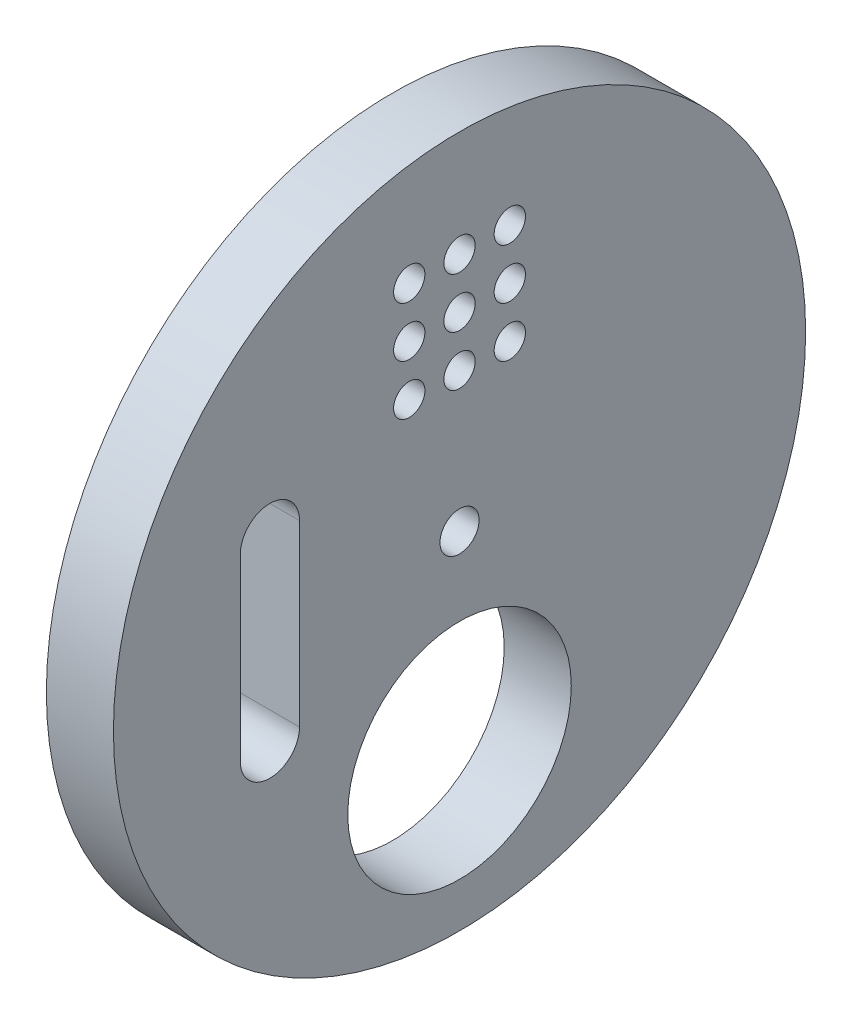
ISO-10303-21;
HEADER;
FILE_DESCRIPTION(('STEP AP214'),'2;1');
FILE_NAME('part.step','',(''),(''),'','','');
FILE_SCHEMA(('AUTOMOTIVE_DESIGN { 1 0 10303 214 1 1 1 1 }'));
ENDSEC;
DATA;
#1=APPLICATION_CONTEXT('core data for automotive mechanical design processes');
#2=APPLICATION_PROTOCOL_DEFINITION('international standard','automotive_design',2000,#1);
#3=PRODUCT_CONTEXT('',#1,'mechanical');
#4=PRODUCT('Part','Part','',(#3));
#5=PRODUCT_RELATED_PRODUCT_CATEGORY('part','',(#4));
#6=PRODUCT_DEFINITION_FORMATION('','',#4);
#7=PRODUCT_DEFINITION_CONTEXT('part definition',#1,'design');
#8=PRODUCT_DEFINITION('design','',#6,#7);
#9=PRODUCT_DEFINITION_SHAPE('','',#8);
#10=(LENGTH_UNIT() NAMED_UNIT(*) SI_UNIT(.MILLI.,.METRE.));
#11=(NAMED_UNIT(*) PLANE_ANGLE_UNIT() SI_UNIT($,.RADIAN.));
#12=(NAMED_UNIT(*) SI_UNIT($,.STERADIAN.) SOLID_ANGLE_UNIT());
#13=UNCERTAINTY_MEASURE_WITH_UNIT(LENGTH_MEASURE(1.E-05),#10,'distance_accuracy_value','');
#14=(GEOMETRIC_REPRESENTATION_CONTEXT(3) GLOBAL_UNCERTAINTY_ASSIGNED_CONTEXT((#13)) GLOBAL_UNIT_ASSIGNED_CONTEXT((#10,
#11,#12)) REPRESENTATION_CONTEXT('',''));
#15=CARTESIAN_POINT('',(0.,0.,0.));
#16=DIRECTION('',(0.,0.,1.));
#17=DIRECTION('',(1.,0.,0.));
#18=AXIS2_PLACEMENT_3D('',#15,#16,#17);
#19=CARTESIAN_POINT('',(12.,-82.0294372515229,0.));
#20=DIRECTION('',(1.,0.,0.));
#21=DIRECTION('',(0.,0.,-1.));
#22=AXIS2_PLACEMENT_3D('',#19,#20,#21);
#23=PLANE('',#22);
#24=CARTESIAN_POINT('',(12.,-65.0588745030457,4.5));
#25=DIRECTION('',(1.,0.,0.));
#26=DIRECTION('',(0.,0.,-1.));
#27=AXIS2_PLACEMENT_3D('',#24,#25,#26);
#28=CIRCLE('',#27,1.4);
#29=CARTESIAN_POINT('',(12.,-65.0588745030457,3.1));
#30=VERTEX_POINT('',#29);
#31=EDGE_CURVE('E127',#30,#30,#28,.T.);
#32=ORIENTED_EDGE('',*,*,#31,.F.);
#33=EDGE_LOOP('',(#32));
#34=FACE_BOUND('',#33,.T.);
#35=CARTESIAN_POINT('',(12.,-69.5588745030457,0.));
#36=DIRECTION('',(1.,0.,0.));
#37=DIRECTION('',(0.,0.,-1.));
#38=AXIS2_PLACEMENT_3D('',#35,#36,#37);
#39=CIRCLE('',#38,1.4);
#40=CARTESIAN_POINT('',(12.,-69.5588745030457,-1.4));
#41=VERTEX_POINT('',#40);
#42=EDGE_CURVE('E137',#41,#41,#39,.T.);
#43=ORIENTED_EDGE('',*,*,#42,.F.);
#44=EDGE_LOOP('',(#43));
#45=FACE_BOUND('',#44,.T.);
#46=CARTESIAN_POINT('',(12.,-65.0588745030457,0.));
#47=DIRECTION('',(1.,0.,0.));
#48=DIRECTION('',(0.,0.,-1.));
#49=AXIS2_PLACEMENT_3D('',#46,#47,#48);
#50=CIRCLE('',#49,1.4);
#51=CARTESIAN_POINT('',(12.,-65.0588745030457,-1.4));
#52=VERTEX_POINT('',#51);
#53=EDGE_CURVE('E149',#52,#52,#50,.T.);
#54=ORIENTED_EDGE('',*,*,#53,.F.);
#55=EDGE_LOOP('',(#54));
#56=FACE_BOUND('',#55,.T.);
#57=CARTESIAN_POINT('',(12.,-60.5588745030457,0.));
#58=DIRECTION('',(1.,0.,0.));
#59=DIRECTION('',(0.,0.,-1.));
#60=AXIS2_PLACEMENT_3D('',#57,#58,#59);
#61=CIRCLE('',#60,1.4);
#62=CARTESIAN_POINT('',(12.,-60.5588745030457,-1.4));
#63=VERTEX_POINT('',#62);
#64=EDGE_CURVE('E161',#63,#63,#61,.T.);
#65=ORIENTED_EDGE('',*,*,#64,.F.);
#66=EDGE_LOOP('',(#65));
#67=FACE_BOUND('',#66,.T.);
#68=CARTESIAN_POINT('',(12.,-60.5588745030457,4.5));
#69=DIRECTION('',(1.,0.,0.));
#70=DIRECTION('',(0.,0.,-1.));
#71=AXIS2_PLACEMENT_3D('',#68,#69,#70);
#72=CIRCLE('',#71,1.4);
#73=CARTESIAN_POINT('',(12.,-60.5588745030457,3.1));
#74=VERTEX_POINT('',#73);
#75=EDGE_CURVE('E172',#74,#74,#72,.T.);
#76=ORIENTED_EDGE('',*,*,#75,.F.);
#77=EDGE_LOOP('',(#76));
#78=FACE_BOUND('',#77,.T.);
#79=CARTESIAN_POINT('',(12.,-82.0294372515229,0.));
#80=DIRECTION('',(1.,0.,0.));
#81=DIRECTION('',(0.,0.,-1.));
#82=AXIS2_PLACEMENT_3D('',#79,#80,#81);
#83=CIRCLE('',#82,30.9705627484771);
#84=CARTESIAN_POINT('',(12.,-82.0294372515229,-30.9705627484771));
#85=VERTEX_POINT('',#84);
#86=EDGE_CURVE('E11',#85,#85,#83,.T.);
#87=ORIENTED_EDGE('',*,*,#86,.T.);
#88=EDGE_LOOP('',(#87));
#89=FACE_BOUND('',#88,.T.);
#90=CARTESIAN_POINT('',(12.,-99.,0.));
#91=DIRECTION('',(1.,0.,0.));
#92=DIRECTION('',(0.,0.,-1.));
#93=AXIS2_PLACEMENT_3D('',#90,#91,#92);
#94=CIRCLE('',#93,10.);
#95=CARTESIAN_POINT('',(12.,-99.,-10.));
#96=VERTEX_POINT('',#95);
#97=EDGE_CURVE('E45',#96,#96,#94,.T.);
#98=ORIENTED_EDGE('',*,*,#97,.F.);
#99=EDGE_LOOP('',(#98));
#100=FACE_BOUND('',#99,.T.);
#101=DIRECTION('',(0.,-1.,0.));
#102=VECTOR('',#101,1.);
#103=CARTESIAN_POINT('',(12.,-74.0294372515229,19.6205627484771));
#104=LINE('',#103,#102);
#105=CARTESIAN_POINT('',(12.,-74.0294372515229,19.6205627484771));
#106=VERTEX_POINT('',#105);
#107=CARTESIAN_POINT('',(12.,-90.0294372515229,19.6205627484771));
#108=VERTEX_POINT('',#107);
#109=EDGE_CURVE('E98',#106,#108,#104,.T.);
#110=ORIENTED_EDGE('',*,*,#109,.F.);
#111=CARTESIAN_POINT('',(12.,-74.0294372515229,16.9705627484772));
#112=DIRECTION('',(1.,0.,0.));
#113=DIRECTION('',(0.,0.,-1.));
#114=AXIS2_PLACEMENT_3D('',#111,#112,#113);
#115=CIRCLE('',#114,2.64999999999999);
#116=CARTESIAN_POINT('',(12.,-74.0294372515229,14.3205627484772));
#117=VERTEX_POINT('',#116);
#118=EDGE_CURVE('E96',#117,#106,#115,.T.);
#119=ORIENTED_EDGE('',*,*,#118,.F.);
#120=DIRECTION('',(0.,1.,0.));
#121=VECTOR('',#120,1.);
#122=CARTESIAN_POINT('',(12.,-74.0294372515229,14.3205627484772));
#123=LINE('',#122,#121);
#124=CARTESIAN_POINT('',(12.,-90.0294372515229,14.3205627484772));
#125=VERTEX_POINT('',#124);
#126=EDGE_CURVE('E58',#125,#117,#123,.T.);
#127=ORIENTED_EDGE('',*,*,#126,.F.);
#128=CARTESIAN_POINT('',(12.,-90.0294372515229,16.9705627484771));
#129=DIRECTION('',(1.,0.,0.));
#130=DIRECTION('',(0.,0.,-1.));
#131=AXIS2_PLACEMENT_3D('',#128,#129,#130);
#132=CIRCLE('',#131,2.64999999999999);
#133=EDGE_CURVE('E90',#108,#125,#132,.T.);
#134=ORIENTED_EDGE('',*,*,#133,.F.);
#135=EDGE_LOOP('',(#110,#119,#127,#134));
#136=FACE_BOUND('',#135,.T.);
#137=CARTESIAN_POINT('',(12.,-82.0294372515229,0.));
#138=DIRECTION('',(1.,0.,0.));
#139=DIRECTION('',(0.,0.,-1.));
#140=AXIS2_PLACEMENT_3D('',#137,#138,#139);
#141=CIRCLE('',#140,1.75);
#142=CARTESIAN_POINT('',(12.,-82.0294372515229,-1.75));
#143=VERTEX_POINT('',#142);
#144=EDGE_CURVE('E167',#143,#143,#141,.T.);
#145=ORIENTED_EDGE('',*,*,#144,.F.);
#146=EDGE_LOOP('',(#145));
#147=FACE_BOUND('',#146,.T.);
#148=CARTESIAN_POINT('',(12.,-60.5588745030457,-4.5));
#149=DIRECTION('',(1.,0.,0.));
#150=DIRECTION('',(0.,0.,-1.));
#151=AXIS2_PLACEMENT_3D('',#148,#149,#150);
#152=CIRCLE('',#151,1.4);
#153=CARTESIAN_POINT('',(12.,-60.5588745030457,-5.9));
#154=VERTEX_POINT('',#153);
#155=EDGE_CURVE('E155',#154,#154,#152,.T.);
#156=ORIENTED_EDGE('',*,*,#155,.F.);
#157=EDGE_LOOP('',(#156));
#158=FACE_BOUND('',#157,.T.);
#159=CARTESIAN_POINT('',(12.,-65.0588745030457,-4.5));
#160=DIRECTION('',(1.,0.,0.));
#161=DIRECTION('',(0.,0.,-1.));
#162=AXIS2_PLACEMENT_3D('',#159,#160,#161);
#163=CIRCLE('',#162,1.4);
#164=CARTESIAN_POINT('',(12.,-65.0588745030457,-5.9));
#165=VERTEX_POINT('',#164);
#166=EDGE_CURVE('E143',#165,#165,#163,.T.);
#167=ORIENTED_EDGE('',*,*,#166,.F.);
#168=EDGE_LOOP('',(#167));
#169=FACE_BOUND('',#168,.T.);
#170=CARTESIAN_POINT('',(12.,-69.5588745030457,-4.5));
#171=DIRECTION('',(1.,0.,0.));
#172=DIRECTION('',(0.,0.,-1.));
#173=AXIS2_PLACEMENT_3D('',#170,#171,#172);
#174=CIRCLE('',#173,1.4);
#175=CARTESIAN_POINT('',(12.,-69.5588745030457,-5.9));
#176=VERTEX_POINT('',#175);
#177=EDGE_CURVE('E130',#176,#176,#174,.T.);
#178=ORIENTED_EDGE('',*,*,#177,.F.);
#179=EDGE_LOOP('',(#178));
#180=FACE_BOUND('',#179,.T.);
#181=CARTESIAN_POINT('',(12.,-69.5588745030457,4.5));
#182=DIRECTION('',(1.,0.,0.));
#183=DIRECTION('',(0.,0.,-1.));
#184=AXIS2_PLACEMENT_3D('',#181,#182,#183);
#185=CIRCLE('',#184,1.4);
#186=CARTESIAN_POINT('',(12.,-69.5588745030457,3.1));
#187=VERTEX_POINT('',#186);
#188=EDGE_CURVE('E126',#187,#187,#185,.T.);
#189=ORIENTED_EDGE('',*,*,#188,.F.);
#190=EDGE_LOOP('',(#189));
#191=FACE_BOUND('',#190,.T.);
#192=ADVANCED_FACE('F37',(#34,#45,#56,#67,#78,#89,#100,#136,#147,#158,#169,#180,#191),#23,.T.);
#193=CARTESIAN_POINT('',(12.,-82.0294372515229,0.));
#194=DIRECTION('',(-1.,0.,0.));
#195=DIRECTION('',(0.,0.,1.));
#196=AXIS2_PLACEMENT_3D('',#193,#194,#195);
#197=CYLINDRICAL_SURFACE('',#196,30.9705627484771);
#198=ORIENTED_EDGE('',*,*,#86,.F.);
#199=EDGE_LOOP('',(#198));
#200=FACE_BOUND('',#199,.T.);
#201=CARTESIAN_POINT('',(6.,-82.0294372515229,0.));
#202=DIRECTION('',(-1.,0.,0.));
#203=DIRECTION('',(0.,0.,1.));
#204=AXIS2_PLACEMENT_3D('',#201,#202,#203);
#205=CIRCLE('',#204,30.9705627484771);
#206=CARTESIAN_POINT('',(6.,-82.0294372515229,30.9705627484771));
#207=VERTEX_POINT('',#206);
#208=EDGE_CURVE('E118',#207,#207,#205,.T.);
#209=ORIENTED_EDGE('',*,*,#208,.F.);
#210=EDGE_LOOP('',(#209));
#211=FACE_BOUND('',#210,.T.);
#212=ADVANCED_FACE('F39',(#200,#211),#197,.T.);
#213=CARTESIAN_POINT('',(12.,-99.,0.));
#214=DIRECTION('',(-1.,0.,0.));
#215=DIRECTION('',(0.,0.,1.));
#216=AXIS2_PLACEMENT_3D('',#213,#214,#215);
#217=CYLINDRICAL_SURFACE('',#216,10.);
#218=ORIENTED_EDGE('',*,*,#97,.T.);
#219=EDGE_LOOP('',(#218));
#220=FACE_BOUND('',#219,.T.);
#221=CARTESIAN_POINT('',(6.,-99.,0.));
#222=DIRECTION('',(1.,0.,0.));
#223=DIRECTION('',(0.,0.,-1.));
#224=AXIS2_PLACEMENT_3D('',#221,#222,#223);
#225=CIRCLE('',#224,10.);
#226=CARTESIAN_POINT('',(6.,-99.,-10.));
#227=VERTEX_POINT('',#226);
#228=EDGE_CURVE('E108',#227,#227,#225,.T.);
#229=ORIENTED_EDGE('',*,*,#228,.F.);
#230=EDGE_LOOP('',(#229));
#231=FACE_BOUND('',#230,.T.);
#232=ADVANCED_FACE('F256',(#220,#231),#217,.F.);
#233=CARTESIAN_POINT('',(12.,-74.0294372515229,16.9705627484772));
#234=DIRECTION('',(-1.,0.,0.));
#235=DIRECTION('',(0.,0.,1.));
#236=AXIS2_PLACEMENT_3D('',#233,#234,#235);
#237=CYLINDRICAL_SURFACE('',#236,2.64999999999999);
#238=CARTESIAN_POINT('',(6.,-74.0294372515229,16.9705627484772));
#239=DIRECTION('',(1.,0.,0.));
#240=DIRECTION('',(0.,0.,-1.));
#241=AXIS2_PLACEMENT_3D('',#238,#239,#240);
#242=CIRCLE('',#241,2.64999999999999);
#243=CARTESIAN_POINT('',(6.,-74.0294372515229,14.3205627484772));
#244=VERTEX_POINT('',#243);
#245=CARTESIAN_POINT('',(6.,-74.0294372515229,19.6205627484771));
#246=VERTEX_POINT('',#245);
#247=EDGE_CURVE('E176',#244,#246,#242,.T.);
#248=ORIENTED_EDGE('',*,*,#247,.F.);
#249=DIRECTION('',(-1.,0.,0.));
#250=VECTOR('',#249,1.);
#251=CARTESIAN_POINT('',(12.,-74.0294372515229,14.3205627484772));
#252=LINE('',#251,#250);
#253=EDGE_CURVE('E92',#117,#244,#252,.T.);
#254=ORIENTED_EDGE('',*,*,#253,.F.);
#255=ORIENTED_EDGE('',*,*,#118,.T.);
#256=DIRECTION('',(-1.,0.,0.));
#257=VECTOR('',#256,1.);
#258=CARTESIAN_POINT('',(12.,-74.0294372515229,19.6205627484771));
#259=LINE('',#258,#257);
#260=EDGE_CURVE('E104',#106,#246,#259,.T.);
#261=ORIENTED_EDGE('',*,*,#260,.T.);
#262=EDGE_LOOP('',(#248,#254,#255,#261));
#263=FACE_BOUND('',#262,.T.);
#264=ADVANCED_FACE('F186',(#263),#237,.F.);
#265=CARTESIAN_POINT('',(12.,-74.0294372515229,19.6205627484771));
#266=DIRECTION('',(0.,0.,-1.));
#267=DIRECTION('',(0.,1.,0.));
#268=AXIS2_PLACEMENT_3D('',#265,#266,#267);
#269=PLANE('',#268);
#270=DIRECTION('',(0.,-1.,0.));
#271=VECTOR('',#270,1.);
#272=CARTESIAN_POINT('',(6.,-74.0294372515229,19.6205627484771));
#273=LINE('',#272,#271);
#274=CARTESIAN_POINT('',(6.,-90.0294372515229,19.6205627484771));
#275=VERTEX_POINT('',#274);
#276=EDGE_CURVE('E71',#246,#275,#273,.T.);
#277=ORIENTED_EDGE('',*,*,#276,.F.);
#278=ORIENTED_EDGE('',*,*,#260,.F.);
#279=ORIENTED_EDGE('',*,*,#109,.T.);
#280=DIRECTION('',(-1.,0.,0.));
#281=VECTOR('',#280,1.);
#282=CARTESIAN_POINT('',(12.,-90.0294372515229,19.6205627484771));
#283=LINE('',#282,#281);
#284=EDGE_CURVE('E91',#108,#275,#283,.T.);
#285=ORIENTED_EDGE('',*,*,#284,.T.);
#286=EDGE_LOOP('',(#277,#278,#279,#285));
#287=FACE_BOUND('',#286,.T.);
#288=ADVANCED_FACE('F184',(#287),#269,.T.);
#289=CARTESIAN_POINT('',(12.,-90.0294372515229,16.9705627484771));
#290=DIRECTION('',(-1.,0.,0.));
#291=DIRECTION('',(0.,0.,1.));
#292=AXIS2_PLACEMENT_3D('',#289,#290,#291);
#293=CYLINDRICAL_SURFACE('',#292,2.64999999999999);
#294=CARTESIAN_POINT('',(6.,-90.0294372515229,16.9705627484771));
#295=DIRECTION('',(1.,0.,0.));
#296=DIRECTION('',(0.,0.,-1.));
#297=AXIS2_PLACEMENT_3D('',#294,#295,#296);
#298=CIRCLE('',#297,2.64999999999999);
#299=CARTESIAN_POINT('',(6.,-90.0294372515229,14.3205627484772));
#300=VERTEX_POINT('',#299);
#301=EDGE_CURVE('E82',#275,#300,#298,.T.);
#302=ORIENTED_EDGE('',*,*,#301,.F.);
#303=ORIENTED_EDGE('',*,*,#284,.F.);
#304=ORIENTED_EDGE('',*,*,#133,.T.);
#305=DIRECTION('',(-1.,0.,0.));
#306=VECTOR('',#305,1.);
#307=CARTESIAN_POINT('',(12.,-90.0294372515229,14.3205627484772));
#308=LINE('',#307,#306);
#309=EDGE_CURVE('E52',#125,#300,#308,.T.);
#310=ORIENTED_EDGE('',*,*,#309,.T.);
#311=EDGE_LOOP('',(#302,#303,#304,#310));
#312=FACE_BOUND('',#311,.T.);
#313=ADVANCED_FACE('F88',(#312),#293,.F.);
#314=CARTESIAN_POINT('',(12.,-74.0294372515229,14.3205627484772));
#315=DIRECTION('',(0.,0.,1.));
#316=DIRECTION('',(0.,-1.,0.));
#317=AXIS2_PLACEMENT_3D('',#314,#315,#316);
#318=PLANE('',#317);
#319=DIRECTION('',(0.,1.,0.));
#320=VECTOR('',#319,1.);
#321=CARTESIAN_POINT('',(6.,-74.0294372515229,14.3205627484772));
#322=LINE('',#321,#320);
#323=EDGE_CURVE('E77',#300,#244,#322,.T.);
#324=ORIENTED_EDGE('',*,*,#323,.F.);
#325=ORIENTED_EDGE('',*,*,#309,.F.);
#326=ORIENTED_EDGE('',*,*,#126,.T.);
#327=ORIENTED_EDGE('',*,*,#253,.T.);
#328=EDGE_LOOP('',(#324,#325,#326,#327));
#329=FACE_BOUND('',#328,.T.);
#330=ADVANCED_FACE('F94',(#329),#318,.T.);
#331=CARTESIAN_POINT('',(12.,-60.5588745030457,4.5));
#332=DIRECTION('',(-1.,0.,0.));
#333=DIRECTION('',(0.,0.,1.));
#334=AXIS2_PLACEMENT_3D('',#331,#332,#333);
#335=CYLINDRICAL_SURFACE('',#334,1.4);
#336=ORIENTED_EDGE('',*,*,#75,.T.);
#337=EDGE_LOOP('',(#336));
#338=FACE_BOUND('',#337,.T.);
#339=CARTESIAN_POINT('',(6.,-60.5588745030457,4.5));
#340=DIRECTION('',(1.,0.,0.));
#341=DIRECTION('',(0.,0.,-1.));
#342=AXIS2_PLACEMENT_3D('',#339,#340,#341);
#343=CIRCLE('',#342,1.4);
#344=CARTESIAN_POINT('',(6.,-60.5588745030457,3.1));
#345=VERTEX_POINT('',#344);
#346=EDGE_CURVE('E110',#345,#345,#343,.T.);
#347=ORIENTED_EDGE('',*,*,#346,.F.);
#348=EDGE_LOOP('',(#347));
#349=FACE_BOUND('',#348,.T.);
#350=ADVANCED_FACE('F243',(#338,#349),#335,.F.);
#351=CARTESIAN_POINT('',(12.,-82.0294372515229,0.));
#352=DIRECTION('',(-1.,0.,0.));
#353=DIRECTION('',(0.,0.,1.));
#354=AXIS2_PLACEMENT_3D('',#351,#352,#353);
#355=CYLINDRICAL_SURFACE('',#354,1.75);
#356=ORIENTED_EDGE('',*,*,#144,.T.);
#357=EDGE_LOOP('',(#356));
#358=FACE_BOUND('',#357,.T.);
#359=CARTESIAN_POINT('',(6.,-82.0294372515229,0.));
#360=DIRECTION('',(1.,0.,0.));
#361=DIRECTION('',(0.,0.,-1.));
#362=AXIS2_PLACEMENT_3D('',#359,#360,#361);
#363=CIRCLE('',#362,1.75);
#364=CARTESIAN_POINT('',(6.,-82.0294372515229,-1.75));
#365=VERTEX_POINT('',#364);
#366=EDGE_CURVE('E115',#365,#365,#363,.T.);
#367=ORIENTED_EDGE('',*,*,#366,.F.);
#368=EDGE_LOOP('',(#367));
#369=FACE_BOUND('',#368,.T.);
#370=ADVANCED_FACE('F239',(#358,#369),#355,.F.);
#371=CARTESIAN_POINT('',(12.,-60.5588745030457,0.));
#372=DIRECTION('',(-1.,0.,0.));
#373=DIRECTION('',(0.,0.,1.));
#374=AXIS2_PLACEMENT_3D('',#371,#372,#373);
#375=CYLINDRICAL_SURFACE('',#374,1.4);
#376=ORIENTED_EDGE('',*,*,#64,.T.);
#377=EDGE_LOOP('',(#376));
#378=FACE_BOUND('',#377,.T.);
#379=CARTESIAN_POINT('',(6.,-60.5588745030457,0.));
#380=DIRECTION('',(1.,0.,0.));
#381=DIRECTION('',(0.,0.,-1.));
#382=AXIS2_PLACEMENT_3D('',#379,#380,#381);
#383=CIRCLE('',#382,1.4);
#384=CARTESIAN_POINT('',(6.,-60.5588745030457,-1.4));
#385=VERTEX_POINT('',#384);
#386=EDGE_CURVE('E164',#385,#385,#383,.T.);
#387=ORIENTED_EDGE('',*,*,#386,.F.);
#388=EDGE_LOOP('',(#387));
#389=FACE_BOUND('',#388,.T.);
#390=ADVANCED_FACE('F235',(#378,#389),#375,.F.);
#391=CARTESIAN_POINT('',(12.,-60.5588745030457,-4.5));
#392=DIRECTION('',(-1.,0.,0.));
#393=DIRECTION('',(0.,0.,1.));
#394=AXIS2_PLACEMENT_3D('',#391,#392,#393);
#395=CYLINDRICAL_SURFACE('',#394,1.4);
#396=ORIENTED_EDGE('',*,*,#155,.T.);
#397=EDGE_LOOP('',(#396));
#398=FACE_BOUND('',#397,.T.);
#399=CARTESIAN_POINT('',(6.,-60.5588745030457,-4.5));
#400=DIRECTION('',(1.,0.,0.));
#401=DIRECTION('',(0.,0.,-1.));
#402=AXIS2_PLACEMENT_3D('',#399,#400,#401);
#403=CIRCLE('',#402,1.4);
#404=CARTESIAN_POINT('',(6.,-60.5588745030457,-5.9));
#405=VERTEX_POINT('',#404);
#406=EDGE_CURVE('E158',#405,#405,#403,.T.);
#407=ORIENTED_EDGE('',*,*,#406,.F.);
#408=EDGE_LOOP('',(#407));
#409=FACE_BOUND('',#408,.T.);
#410=ADVANCED_FACE('F231',(#398,#409),#395,.F.);
#411=CARTESIAN_POINT('',(12.,-65.0588745030457,0.));
#412=DIRECTION('',(-1.,0.,0.));
#413=DIRECTION('',(0.,0.,1.));
#414=AXIS2_PLACEMENT_3D('',#411,#412,#413);
#415=CYLINDRICAL_SURFACE('',#414,1.4);
#416=ORIENTED_EDGE('',*,*,#53,.T.);
#417=EDGE_LOOP('',(#416));
#418=FACE_BOUND('',#417,.T.);
#419=CARTESIAN_POINT('',(6.,-65.0588745030457,0.));
#420=DIRECTION('',(1.,0.,0.));
#421=DIRECTION('',(0.,0.,-1.));
#422=AXIS2_PLACEMENT_3D('',#419,#420,#421);
#423=CIRCLE('',#422,1.4);
#424=CARTESIAN_POINT('',(6.,-65.0588745030457,-1.4));
#425=VERTEX_POINT('',#424);
#426=EDGE_CURVE('E152',#425,#425,#423,.T.);
#427=ORIENTED_EDGE('',*,*,#426,.F.);
#428=EDGE_LOOP('',(#427));
#429=FACE_BOUND('',#428,.T.);
#430=ADVANCED_FACE('F227',(#418,#429),#415,.F.);
#431=CARTESIAN_POINT('',(12.,-65.0588745030457,-4.5));
#432=DIRECTION('',(-1.,0.,0.));
#433=DIRECTION('',(0.,0.,1.));
#434=AXIS2_PLACEMENT_3D('',#431,#432,#433);
#435=CYLINDRICAL_SURFACE('',#434,1.4);
#436=ORIENTED_EDGE('',*,*,#166,.T.);
#437=EDGE_LOOP('',(#436));
#438=FACE_BOUND('',#437,.T.);
#439=CARTESIAN_POINT('',(6.,-65.0588745030457,-4.5));
#440=DIRECTION('',(1.,0.,0.));
#441=DIRECTION('',(0.,0.,-1.));
#442=AXIS2_PLACEMENT_3D('',#439,#440,#441);
#443=CIRCLE('',#442,1.4);
#444=CARTESIAN_POINT('',(6.,-65.0588745030457,-5.9));
#445=VERTEX_POINT('',#444);
#446=EDGE_CURVE('E146',#445,#445,#443,.T.);
#447=ORIENTED_EDGE('',*,*,#446,.F.);
#448=EDGE_LOOP('',(#447));
#449=FACE_BOUND('',#448,.T.);
#450=ADVANCED_FACE('F223',(#438,#449),#435,.F.);
#451=CARTESIAN_POINT('',(12.,-69.5588745030457,0.));
#452=DIRECTION('',(-1.,0.,0.));
#453=DIRECTION('',(0.,0.,1.));
#454=AXIS2_PLACEMENT_3D('',#451,#452,#453);
#455=CYLINDRICAL_SURFACE('',#454,1.4);
#456=ORIENTED_EDGE('',*,*,#42,.T.);
#457=EDGE_LOOP('',(#456));
#458=FACE_BOUND('',#457,.T.);
#459=CARTESIAN_POINT('',(6.,-69.5588745030457,0.));
#460=DIRECTION('',(1.,0.,0.));
#461=DIRECTION('',(0.,0.,-1.));
#462=AXIS2_PLACEMENT_3D('',#459,#460,#461);
#463=CIRCLE('',#462,1.4);
#464=CARTESIAN_POINT('',(6.,-69.5588745030457,-1.4));
#465=VERTEX_POINT('',#464);
#466=EDGE_CURVE('E140',#465,#465,#463,.T.);
#467=ORIENTED_EDGE('',*,*,#466,.F.);
#468=EDGE_LOOP('',(#467));
#469=FACE_BOUND('',#468,.T.);
#470=ADVANCED_FACE('F219',(#458,#469),#455,.F.);
#471=CARTESIAN_POINT('',(12.,-69.5588745030457,-4.5));
#472=DIRECTION('',(-1.,0.,0.));
#473=DIRECTION('',(0.,0.,1.));
#474=AXIS2_PLACEMENT_3D('',#471,#472,#473);
#475=CYLINDRICAL_SURFACE('',#474,1.4);
#476=ORIENTED_EDGE('',*,*,#177,.T.);
#477=EDGE_LOOP('',(#476));
#478=FACE_BOUND('',#477,.T.);
#479=CARTESIAN_POINT('',(6.,-69.5588745030457,-4.5));
#480=DIRECTION('',(1.,0.,0.));
#481=DIRECTION('',(0.,0.,-1.));
#482=AXIS2_PLACEMENT_3D('',#479,#480,#481);
#483=CIRCLE('',#482,1.4);
#484=CARTESIAN_POINT('',(6.,-69.5588745030457,-5.9));
#485=VERTEX_POINT('',#484);
#486=EDGE_CURVE('E134',#485,#485,#483,.T.);
#487=ORIENTED_EDGE('',*,*,#486,.F.);
#488=EDGE_LOOP('',(#487));
#489=FACE_BOUND('',#488,.T.);
#490=ADVANCED_FACE('F213',(#478,#489),#475,.F.);
#491=CARTESIAN_POINT('',(12.,-65.0588745030457,4.5));
#492=DIRECTION('',(-1.,0.,0.));
#493=DIRECTION('',(0.,0.,1.));
#494=AXIS2_PLACEMENT_3D('',#491,#492,#493);
#495=CYLINDRICAL_SURFACE('',#494,1.4);
#496=ORIENTED_EDGE('',*,*,#31,.T.);
#497=EDGE_LOOP('',(#496));
#498=FACE_BOUND('',#497,.T.);
#499=CARTESIAN_POINT('',(6.,-65.0588745030457,4.5));
#500=DIRECTION('',(1.,0.,0.));
#501=DIRECTION('',(0.,0.,-1.));
#502=AXIS2_PLACEMENT_3D('',#499,#500,#501);
#503=CIRCLE('',#502,1.4);
#504=CARTESIAN_POINT('',(6.,-65.0588745030457,3.1));
#505=VERTEX_POINT('',#504);
#506=EDGE_CURVE('E131',#505,#505,#503,.T.);
#507=ORIENTED_EDGE('',*,*,#506,.F.);
#508=EDGE_LOOP('',(#507));
#509=FACE_BOUND('',#508,.T.);
#510=ADVANCED_FACE('F206',(#498,#509),#495,.F.);
#511=CARTESIAN_POINT('',(12.,-69.5588745030457,4.5));
#512=DIRECTION('',(-1.,0.,0.));
#513=DIRECTION('',(0.,0.,1.));
#514=AXIS2_PLACEMENT_3D('',#511,#512,#513);
#515=CYLINDRICAL_SURFACE('',#514,1.4);
#516=ORIENTED_EDGE('',*,*,#188,.T.);
#517=EDGE_LOOP('',(#516));
#518=FACE_BOUND('',#517,.T.);
#519=CARTESIAN_POINT('',(6.,-69.5588745030457,4.5));
#520=DIRECTION('',(1.,0.,0.));
#521=DIRECTION('',(0.,0.,-1.));
#522=AXIS2_PLACEMENT_3D('',#519,#520,#521);
#523=CIRCLE('',#522,1.4);
#524=CARTESIAN_POINT('',(6.,-69.5588745030457,3.1));
#525=VERTEX_POINT('',#524);
#526=EDGE_CURVE('E111',#525,#525,#523,.T.);
#527=ORIENTED_EDGE('',*,*,#526,.F.);
#528=EDGE_LOOP('',(#527));
#529=FACE_BOUND('',#528,.T.);
#530=ADVANCED_FACE('F203',(#518,#529),#515,.F.);
#531=CARTESIAN_POINT('',(6.,0.,0.));
#532=DIRECTION('',(-1.,0.,0.));
#533=DIRECTION('',(0.,0.,1.));
#534=AXIS2_PLACEMENT_3D('',#531,#532,#533);
#535=PLANE('',#534);
#536=ORIENTED_EDGE('',*,*,#228,.T.);
#537=EDGE_LOOP('',(#536));
#538=FACE_BOUND('',#537,.T.);
#539=ORIENTED_EDGE('',*,*,#526,.T.);
#540=EDGE_LOOP('',(#539));
#541=FACE_BOUND('',#540,.T.);
#542=ORIENTED_EDGE('',*,*,#208,.T.);
#543=EDGE_LOOP('',(#542));
#544=FACE_BOUND('',#543,.T.);
#545=ORIENTED_EDGE('',*,*,#323,.T.);
#546=ORIENTED_EDGE('',*,*,#247,.T.);
#547=ORIENTED_EDGE('',*,*,#276,.T.);
#548=ORIENTED_EDGE('',*,*,#301,.T.);
#549=EDGE_LOOP('',(#545,#546,#547,#548));
#550=FACE_BOUND('',#549,.T.);
#551=ORIENTED_EDGE('',*,*,#346,.T.);
#552=EDGE_LOOP('',(#551));
#553=FACE_BOUND('',#552,.T.);
#554=ORIENTED_EDGE('',*,*,#366,.T.);
#555=EDGE_LOOP('',(#554));
#556=FACE_BOUND('',#555,.T.);
#557=ORIENTED_EDGE('',*,*,#386,.T.);
#558=EDGE_LOOP('',(#557));
#559=FACE_BOUND('',#558,.T.);
#560=ORIENTED_EDGE('',*,*,#406,.T.);
#561=EDGE_LOOP('',(#560));
#562=FACE_BOUND('',#561,.T.);
#563=ORIENTED_EDGE('',*,*,#426,.T.);
#564=EDGE_LOOP('',(#563));
#565=FACE_BOUND('',#564,.T.);
#566=ORIENTED_EDGE('',*,*,#446,.T.);
#567=EDGE_LOOP('',(#566));
#568=FACE_BOUND('',#567,.T.);
#569=ORIENTED_EDGE('',*,*,#466,.T.);
#570=EDGE_LOOP('',(#569));
#571=FACE_BOUND('',#570,.T.);
#572=ORIENTED_EDGE('',*,*,#486,.T.);
#573=EDGE_LOOP('',(#572));
#574=FACE_BOUND('',#573,.T.);
#575=ORIENTED_EDGE('',*,*,#506,.T.);
#576=EDGE_LOOP('',(#575));
#577=FACE_BOUND('',#576,.T.);
#578=ADVANCED_FACE('F83',(#538,#541,#544,#550,#553,#556,#559,#562,#565,#568,#571,#574,#577),
#535,.T.);
#579=CLOSED_SHELL('',(#192,#212,#232,#264,#288,#313,#330,#350,#370,#390,#410,#430,#450,#470,
#490,#510,#530,#578));
#580=MANIFOLD_SOLID_BREP('B2',#579);
#581=ADVANCED_BREP_SHAPE_REPRESENTATION('',(#18,#580),#14);
#582=SHAPE_DEFINITION_REPRESENTATION(#9,#581);
ENDSEC;
END-ISO-10303-21;
